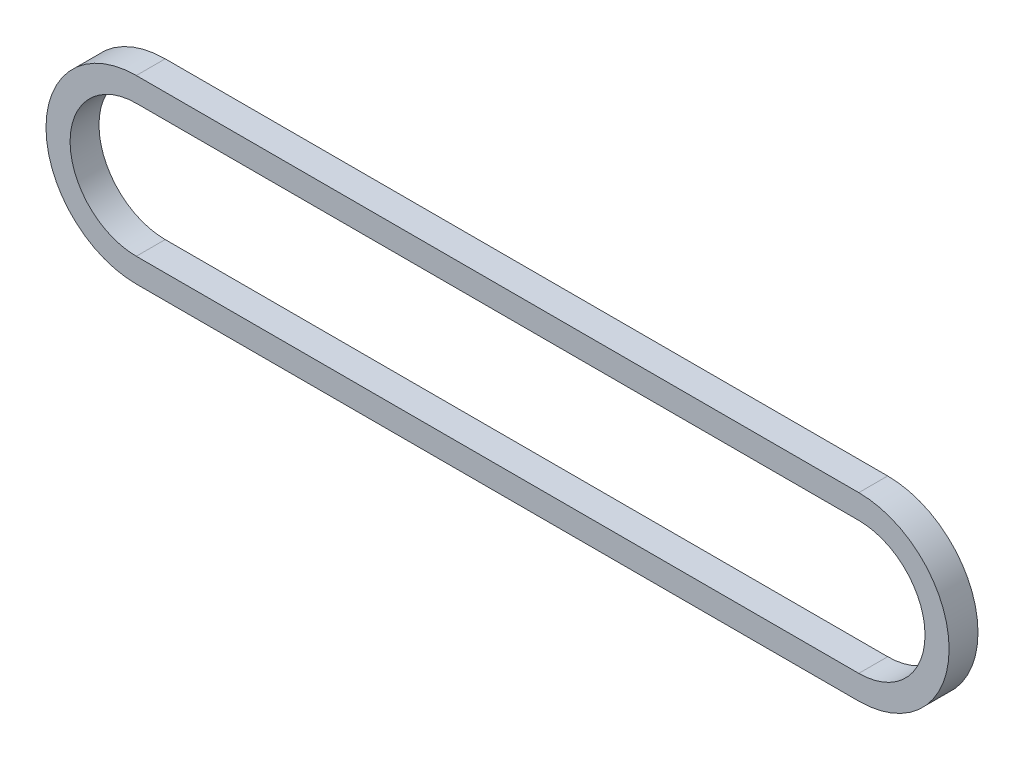
ISO-10303-21;
HEADER;
FILE_DESCRIPTION(('STEP AP214'),'2;1');
FILE_NAME('part.step','',(''),(''),'','','');
FILE_SCHEMA(('AUTOMOTIVE_DESIGN { 1 0 10303 214 1 1 1 1 }'));
ENDSEC;
DATA;
#1=APPLICATION_CONTEXT('core data for automotive mechanical design processes');
#2=APPLICATION_PROTOCOL_DEFINITION('international standard','automotive_design',2000,#1);
#3=PRODUCT_CONTEXT('',#1,'mechanical');
#4=PRODUCT('Part','Part','',(#3));
#5=PRODUCT_RELATED_PRODUCT_CATEGORY('part','',(#4));
#6=PRODUCT_DEFINITION_FORMATION('','',#4);
#7=PRODUCT_DEFINITION_CONTEXT('part definition',#1,'design');
#8=PRODUCT_DEFINITION('design','',#6,#7);
#9=PRODUCT_DEFINITION_SHAPE('','',#8);
#10=(LENGTH_UNIT() NAMED_UNIT(*) SI_UNIT(.MILLI.,.METRE.));
#11=(NAMED_UNIT(*) PLANE_ANGLE_UNIT() SI_UNIT($,.RADIAN.));
#12=(NAMED_UNIT(*) SI_UNIT($,.STERADIAN.) SOLID_ANGLE_UNIT());
#13=UNCERTAINTY_MEASURE_WITH_UNIT(LENGTH_MEASURE(1.E-05),#10,'distance_accuracy_value','');
#14=(GEOMETRIC_REPRESENTATION_CONTEXT(3) GLOBAL_UNCERTAINTY_ASSIGNED_CONTEXT((#13)) GLOBAL_UNIT_ASSIGNED_CONTEXT((#10,
#11,#12)) REPRESENTATION_CONTEXT('',''));
#15=CARTESIAN_POINT('',(0.,0.,0.));
#16=DIRECTION('',(0.,0.,1.));
#17=DIRECTION('',(1.,0.,0.));
#18=AXIS2_PLACEMENT_3D('',#15,#16,#17);
#19=CARTESIAN_POINT('',(-150.,0.,6.));
#20=DIRECTION('',(0.,0.,1.));
#21=DIRECTION('',(1.,0.,0.));
#22=AXIS2_PLACEMENT_3D('',#19,#20,#21);
#23=PLANE('',#22);
#24=CARTESIAN_POINT('',(-150.,0.,6.));
#25=DIRECTION('',(0.,0.,1.));
#26=DIRECTION('',(1.,0.,0.));
#27=AXIS2_PLACEMENT_3D('',#24,#25,#26);
#28=CIRCLE('',#27,37.5);
#29=CARTESIAN_POINT('',(-150.,37.5,6.));
#30=VERTEX_POINT('',#29);
#31=CARTESIAN_POINT('',(-150.,-37.5,6.));
#32=VERTEX_POINT('',#31);
#33=EDGE_CURVE('E135',#30,#32,#28,.T.);
#34=ORIENTED_EDGE('',*,*,#33,.T.);
#35=DIRECTION('',(1.,0.,0.));
#36=VECTOR('',#35,1.);
#37=CARTESIAN_POINT('',(-150.,-37.5,6.));
#38=LINE('',#37,#36);
#39=CARTESIAN_POINT('',(150.,-37.5000000000001,6.));
#40=VERTEX_POINT('',#39);
#41=EDGE_CURVE('E138',#32,#40,#38,.T.);
#42=ORIENTED_EDGE('',*,*,#41,.T.);
#43=CARTESIAN_POINT('',(150.,0.,6.));
#44=DIRECTION('',(0.,0.,1.));
#45=DIRECTION('',(1.,0.,0.));
#46=AXIS2_PLACEMENT_3D('',#43,#44,#45);
#47=CIRCLE('',#46,37.5);
#48=CARTESIAN_POINT('',(150.,37.5,6.));
#49=VERTEX_POINT('',#48);
#50=EDGE_CURVE('E141',#40,#49,#47,.T.);
#51=ORIENTED_EDGE('',*,*,#50,.T.);
#52=DIRECTION('',(-1.,0.,0.));
#53=VECTOR('',#52,1.);
#54=CARTESIAN_POINT('',(-150.,37.5,6.));
#55=LINE('',#54,#53);
#56=EDGE_CURVE('E143',#49,#30,#55,.T.);
#57=ORIENTED_EDGE('',*,*,#56,.T.);
#58=EDGE_LOOP('',(#34,#42,#51,#57));
#59=FACE_BOUND('',#58,.T.);
#60=DIRECTION('',(1.,0.,0.));
#61=VECTOR('',#60,1.);
#62=CARTESIAN_POINT('',(-150.,-27.5,6.));
#63=LINE('',#62,#61);
#64=CARTESIAN_POINT('',(-150.,-27.5,6.));
#65=VERTEX_POINT('',#64);
#66=CARTESIAN_POINT('',(150.,-27.5,6.));
#67=VERTEX_POINT('',#66);
#68=EDGE_CURVE('E107',#65,#67,#63,.T.);
#69=ORIENTED_EDGE('',*,*,#68,.F.);
#70=CARTESIAN_POINT('',(-150.,0.,6.));
#71=DIRECTION('',(0.,0.,1.));
#72=DIRECTION('',(1.,0.,0.));
#73=AXIS2_PLACEMENT_3D('',#70,#71,#72);
#74=CIRCLE('',#73,27.5);
#75=CARTESIAN_POINT('',(-150.,27.5,6.));
#76=VERTEX_POINT('',#75);
#77=EDGE_CURVE('E99',#76,#65,#74,.T.);
#78=ORIENTED_EDGE('',*,*,#77,.F.);
#79=DIRECTION('',(-1.,0.,0.));
#80=VECTOR('',#79,1.);
#81=CARTESIAN_POINT('',(-150.,27.5,6.));
#82=LINE('',#81,#80);
#83=CARTESIAN_POINT('',(150.,27.5,6.));
#84=VERTEX_POINT('',#83);
#85=EDGE_CURVE('E121',#84,#76,#82,.T.);
#86=ORIENTED_EDGE('',*,*,#85,.F.);
#87=CARTESIAN_POINT('',(150.,0.,6.));
#88=DIRECTION('',(0.,0.,1.));
#89=DIRECTION('',(1.,0.,0.));
#90=AXIS2_PLACEMENT_3D('',#87,#88,#89);
#91=CIRCLE('',#90,27.5);
#92=EDGE_CURVE('E119',#67,#84,#91,.T.);
#93=ORIENTED_EDGE('',*,*,#92,.F.);
#94=EDGE_LOOP('',(#69,#78,#86,#93));
#95=FACE_BOUND('',#94,.T.);
#96=ADVANCED_FACE('F34',(#59,#95),#23,.T.);
#97=CARTESIAN_POINT('',(-150.,0.,-6.));
#98=DIRECTION('',(0.,0.,1.));
#99=DIRECTION('',(1.,0.,0.));
#100=AXIS2_PLACEMENT_3D('',#97,#98,#99);
#101=PLANE('',#100);
#102=CARTESIAN_POINT('',(-150.,0.,-6.));
#103=DIRECTION('',(0.,0.,1.));
#104=DIRECTION('',(1.,0.,0.));
#105=AXIS2_PLACEMENT_3D('',#102,#103,#104);
#106=CIRCLE('',#105,37.5);
#107=CARTESIAN_POINT('',(-150.,37.5,-6.));
#108=VERTEX_POINT('',#107);
#109=CARTESIAN_POINT('',(-150.,-37.5,-6.));
#110=VERTEX_POINT('',#109);
#111=EDGE_CURVE('E115',#108,#110,#106,.T.);
#112=ORIENTED_EDGE('',*,*,#111,.F.);
#113=DIRECTION('',(-1.,0.,0.));
#114=VECTOR('',#113,1.);
#115=CARTESIAN_POINT('',(-150.,37.5,-6.));
#116=LINE('',#115,#114);
#117=CARTESIAN_POINT('',(150.,37.5,-6.));
#118=VERTEX_POINT('',#117);
#119=EDGE_CURVE('E139',#118,#108,#116,.T.);
#120=ORIENTED_EDGE('',*,*,#119,.F.);
#121=CARTESIAN_POINT('',(150.,0.,-6.));
#122=DIRECTION('',(0.,0.,1.));
#123=DIRECTION('',(1.,0.,0.));
#124=AXIS2_PLACEMENT_3D('',#121,#122,#123);
#125=CIRCLE('',#124,37.5);
#126=CARTESIAN_POINT('',(150.,-37.5000000000001,-6.));
#127=VERTEX_POINT('',#126);
#128=EDGE_CURVE('E150',#127,#118,#125,.T.);
#129=ORIENTED_EDGE('',*,*,#128,.F.);
#130=DIRECTION('',(1.,0.,0.));
#131=VECTOR('',#130,1.);
#132=CARTESIAN_POINT('',(-150.,-37.5,-6.));
#133=LINE('',#132,#131);
#134=EDGE_CURVE('E148',#110,#127,#133,.T.);
#135=ORIENTED_EDGE('',*,*,#134,.F.);
#136=EDGE_LOOP('',(#112,#120,#129,#135));
#137=FACE_BOUND('',#136,.T.);
#138=CARTESIAN_POINT('',(-150.,0.,-6.));
#139=DIRECTION('',(0.,0.,1.));
#140=DIRECTION('',(1.,0.,0.));
#141=AXIS2_PLACEMENT_3D('',#138,#139,#140);
#142=CIRCLE('',#141,27.5);
#143=CARTESIAN_POINT('',(-150.,27.5,-6.));
#144=VERTEX_POINT('',#143);
#145=CARTESIAN_POINT('',(-150.,-27.5,-6.));
#146=VERTEX_POINT('',#145);
#147=EDGE_CURVE('E57',#144,#146,#142,.T.);
#148=ORIENTED_EDGE('',*,*,#147,.T.);
#149=DIRECTION('',(1.,0.,0.));
#150=VECTOR('',#149,1.);
#151=CARTESIAN_POINT('',(-150.,-27.5,-6.));
#152=LINE('',#151,#150);
#153=CARTESIAN_POINT('',(150.,-27.5,-6.));
#154=VERTEX_POINT('',#153);
#155=EDGE_CURVE('E114',#146,#154,#152,.T.);
#156=ORIENTED_EDGE('',*,*,#155,.T.);
#157=CARTESIAN_POINT('',(150.,0.,-6.));
#158=DIRECTION('',(0.,0.,1.));
#159=DIRECTION('',(1.,0.,0.));
#160=AXIS2_PLACEMENT_3D('',#157,#158,#159);
#161=CIRCLE('',#160,27.5);
#162=CARTESIAN_POINT('',(150.,27.5,-6.));
#163=VERTEX_POINT('',#162);
#164=EDGE_CURVE('E127',#154,#163,#161,.T.);
#165=ORIENTED_EDGE('',*,*,#164,.T.);
#166=DIRECTION('',(-1.,0.,0.));
#167=VECTOR('',#166,1.);
#168=CARTESIAN_POINT('',(-150.,27.5,-6.));
#169=LINE('',#168,#167);
#170=EDGE_CURVE('E108',#163,#144,#169,.T.);
#171=ORIENTED_EDGE('',*,*,#170,.T.);
#172=EDGE_LOOP('',(#148,#156,#165,#171));
#173=FACE_BOUND('',#172,.T.);
#174=ADVANCED_FACE('F168',(#137,#173),#101,.F.);
#175=CARTESIAN_POINT('',(-150.,0.,6.));
#176=DIRECTION('',(0.,0.,-1.));
#177=DIRECTION('',(-1.,0.,0.));
#178=AXIS2_PLACEMENT_3D('',#175,#176,#177);
#179=CYLINDRICAL_SURFACE('',#178,37.5);
#180=ORIENTED_EDGE('',*,*,#111,.T.);
#181=DIRECTION('',(0.,0.,-1.));
#182=VECTOR('',#181,1.);
#183=CARTESIAN_POINT('',(-150.,-37.5,6.));
#184=LINE('',#183,#182);
#185=EDGE_CURVE('E11',#32,#110,#184,.T.);
#186=ORIENTED_EDGE('',*,*,#185,.F.);
#187=ORIENTED_EDGE('',*,*,#33,.F.);
#188=DIRECTION('',(0.,0.,-1.));
#189=VECTOR('',#188,1.);
#190=CARTESIAN_POINT('',(-150.,37.5,6.));
#191=LINE('',#190,#189);
#192=EDGE_CURVE('E145',#30,#108,#191,.T.);
#193=ORIENTED_EDGE('',*,*,#192,.T.);
#194=EDGE_LOOP('',(#180,#186,#187,#193));
#195=FACE_BOUND('',#194,.T.);
#196=ADVANCED_FACE('F36',(#195),#179,.T.);
#197=CARTESIAN_POINT('',(-150.,-37.5,6.));
#198=DIRECTION('',(0.,1.,0.));
#199=DIRECTION('',(0.,0.,1.));
#200=AXIS2_PLACEMENT_3D('',#197,#198,#199);
#201=PLANE('',#200);
#202=ORIENTED_EDGE('',*,*,#134,.T.);
#203=DIRECTION('',(0.,0.,-1.));
#204=VECTOR('',#203,1.);
#205=CARTESIAN_POINT('',(150.,-37.5000000000001,6.));
#206=LINE('',#205,#204);
#207=EDGE_CURVE('E42',#40,#127,#206,.T.);
#208=ORIENTED_EDGE('',*,*,#207,.F.);
#209=ORIENTED_EDGE('',*,*,#41,.F.);
#210=ORIENTED_EDGE('',*,*,#185,.T.);
#211=EDGE_LOOP('',(#202,#208,#209,#210));
#212=FACE_BOUND('',#211,.T.);
#213=ADVANCED_FACE('F178',(#212),#201,.F.);
#214=CARTESIAN_POINT('',(150.,0.,6.));
#215=DIRECTION('',(0.,0.,-1.));
#216=DIRECTION('',(-1.,0.,0.));
#217=AXIS2_PLACEMENT_3D('',#214,#215,#216);
#218=CYLINDRICAL_SURFACE('',#217,37.5);
#219=ORIENTED_EDGE('',*,*,#128,.T.);
#220=DIRECTION('',(0.,0.,-1.));
#221=VECTOR('',#220,1.);
#222=CARTESIAN_POINT('',(150.,37.5,6.));
#223=LINE('',#222,#221);
#224=EDGE_CURVE('E155',#49,#118,#223,.T.);
#225=ORIENTED_EDGE('',*,*,#224,.F.);
#226=ORIENTED_EDGE('',*,*,#50,.F.);
#227=ORIENTED_EDGE('',*,*,#207,.T.);
#228=EDGE_LOOP('',(#219,#225,#226,#227));
#229=FACE_BOUND('',#228,.T.);
#230=ADVANCED_FACE('F162',(#229),#218,.T.);
#231=CARTESIAN_POINT('',(-150.,37.5,6.));
#232=DIRECTION('',(0.,-1.,0.));
#233=DIRECTION('',(0.,0.,-1.));
#234=AXIS2_PLACEMENT_3D('',#231,#232,#233);
#235=PLANE('',#234);
#236=ORIENTED_EDGE('',*,*,#119,.T.);
#237=ORIENTED_EDGE('',*,*,#192,.F.);
#238=ORIENTED_EDGE('',*,*,#56,.F.);
#239=ORIENTED_EDGE('',*,*,#224,.T.);
#240=EDGE_LOOP('',(#236,#237,#238,#239));
#241=FACE_BOUND('',#240,.T.);
#242=ADVANCED_FACE('F172',(#241),#235,.F.);
#243=CARTESIAN_POINT('',(-150.,0.,6.));
#244=DIRECTION('',(0.,0.,-1.));
#245=DIRECTION('',(-1.,0.,0.));
#246=AXIS2_PLACEMENT_3D('',#243,#244,#245);
#247=CYLINDRICAL_SURFACE('',#246,27.5);
#248=ORIENTED_EDGE('',*,*,#147,.F.);
#249=DIRECTION('',(0.,0.,-1.));
#250=VECTOR('',#249,1.);
#251=CARTESIAN_POINT('',(-150.,27.5,6.));
#252=LINE('',#251,#250);
#253=EDGE_CURVE('E103',#76,#144,#252,.T.);
#254=ORIENTED_EDGE('',*,*,#253,.F.);
#255=ORIENTED_EDGE('',*,*,#77,.T.);
#256=DIRECTION('',(0.,0.,-1.));
#257=VECTOR('',#256,1.);
#258=CARTESIAN_POINT('',(-150.,-27.5,6.));
#259=LINE('',#258,#257);
#260=EDGE_CURVE('E102',#65,#146,#259,.T.);
#261=ORIENTED_EDGE('',*,*,#260,.T.);
#262=EDGE_LOOP('',(#248,#254,#255,#261));
#263=FACE_BOUND('',#262,.T.);
#264=ADVANCED_FACE('F101',(#263),#247,.F.);
#265=CARTESIAN_POINT('',(-150.,-27.5,6.));
#266=DIRECTION('',(0.,1.,0.));
#267=DIRECTION('',(-1.,0.,0.));
#268=AXIS2_PLACEMENT_3D('',#265,#266,#267);
#269=PLANE('',#268);
#270=ORIENTED_EDGE('',*,*,#155,.F.);
#271=ORIENTED_EDGE('',*,*,#260,.F.);
#272=ORIENTED_EDGE('',*,*,#68,.T.);
#273=DIRECTION('',(0.,0.,-1.));
#274=VECTOR('',#273,1.);
#275=CARTESIAN_POINT('',(150.,-27.5,6.));
#276=LINE('',#275,#274);
#277=EDGE_CURVE('E116',#67,#154,#276,.T.);
#278=ORIENTED_EDGE('',*,*,#277,.T.);
#279=EDGE_LOOP('',(#270,#271,#272,#278));
#280=FACE_BOUND('',#279,.T.);
#281=ADVANCED_FACE('F111',(#280),#269,.T.);
#282=CARTESIAN_POINT('',(150.,0.,6.));
#283=DIRECTION('',(0.,0.,-1.));
#284=DIRECTION('',(-1.,0.,0.));
#285=AXIS2_PLACEMENT_3D('',#282,#283,#284);
#286=CYLINDRICAL_SURFACE('',#285,27.5);
#287=ORIENTED_EDGE('',*,*,#164,.F.);
#288=ORIENTED_EDGE('',*,*,#277,.F.);
#289=ORIENTED_EDGE('',*,*,#92,.T.);
#290=DIRECTION('',(0.,0.,-1.));
#291=VECTOR('',#290,1.);
#292=CARTESIAN_POINT('',(150.,27.5,6.));
#293=LINE('',#292,#291);
#294=EDGE_CURVE('E49',#84,#163,#293,.T.);
#295=ORIENTED_EDGE('',*,*,#294,.T.);
#296=EDGE_LOOP('',(#287,#288,#289,#295));
#297=FACE_BOUND('',#296,.T.);
#298=ADVANCED_FACE('F201',(#297),#286,.F.);
#299=CARTESIAN_POINT('',(-150.,27.5,6.));
#300=DIRECTION('',(0.,-1.,0.));
#301=DIRECTION('',(1.,0.,0.));
#302=AXIS2_PLACEMENT_3D('',#299,#300,#301);
#303=PLANE('',#302);
#304=ORIENTED_EDGE('',*,*,#170,.F.);
#305=ORIENTED_EDGE('',*,*,#294,.F.);
#306=ORIENTED_EDGE('',*,*,#85,.T.);
#307=ORIENTED_EDGE('',*,*,#253,.T.);
#308=EDGE_LOOP('',(#304,#305,#306,#307));
#309=FACE_BOUND('',#308,.T.);
#310=ADVANCED_FACE('F205',(#309),#303,.T.);
#311=CLOSED_SHELL('',(#96,#174,#196,#213,#230,#242,#264,#281,#298,#310));
#312=MANIFOLD_SOLID_BREP('B2',#311);
#313=ADVANCED_BREP_SHAPE_REPRESENTATION('',(#18,#312),#14);
#314=SHAPE_DEFINITION_REPRESENTATION(#9,#313);
ENDSEC;
END-ISO-10303-21;
